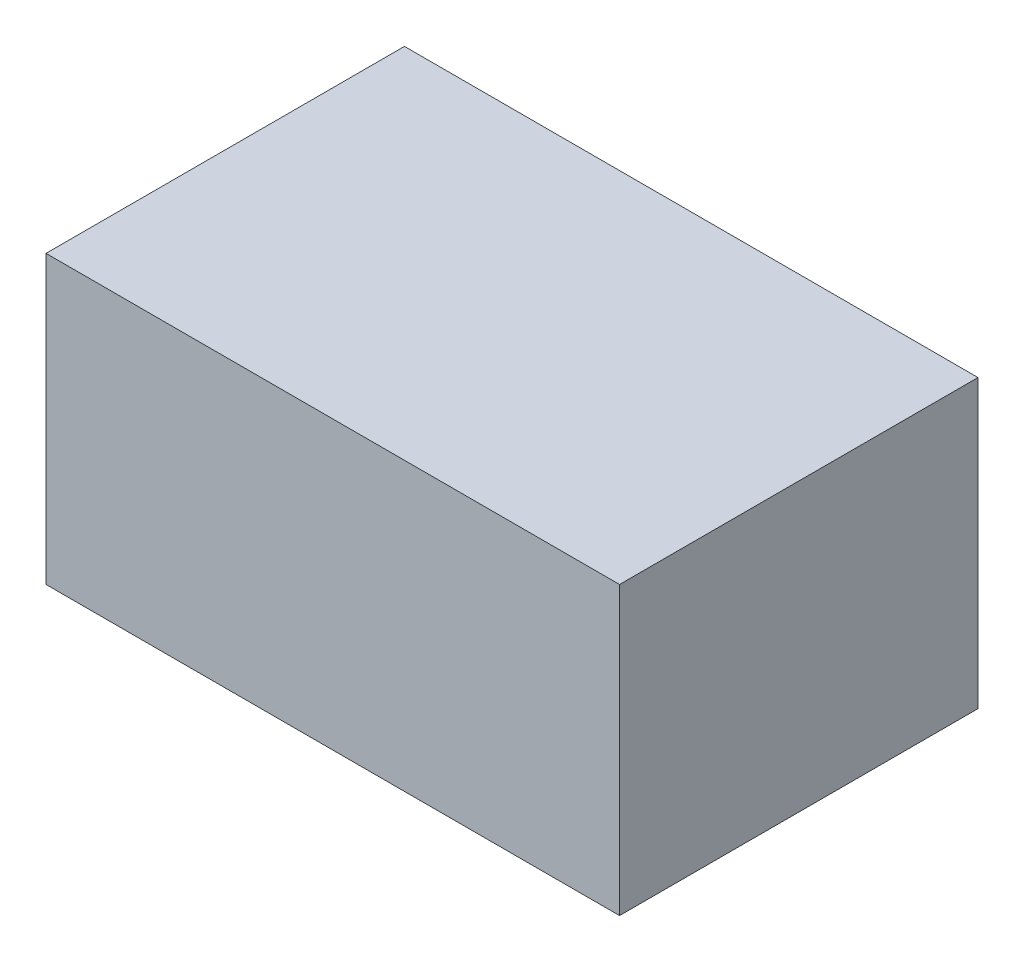
ISO-10303-21;
HEADER;
FILE_DESCRIPTION(('STEP AP214'),'2;1');
FILE_NAME('part.step','',(''),(''),'','','');
FILE_SCHEMA(('AUTOMOTIVE_DESIGN { 1 0 10303 214 1 1 1 1 }'));
ENDSEC;
DATA;
#1=APPLICATION_CONTEXT('core data for automotive mechanical design processes');
#2=APPLICATION_PROTOCOL_DEFINITION('international standard','automotive_design',2000,#1);
#3=PRODUCT_CONTEXT('',#1,'mechanical');
#4=PRODUCT('Part','Part','',(#3));
#5=PRODUCT_RELATED_PRODUCT_CATEGORY('part','',(#4));
#6=PRODUCT_DEFINITION_FORMATION('','',#4);
#7=PRODUCT_DEFINITION_CONTEXT('part definition',#1,'design');
#8=PRODUCT_DEFINITION('design','',#6,#7);
#9=PRODUCT_DEFINITION_SHAPE('','',#8);
#10=(LENGTH_UNIT() NAMED_UNIT(*) SI_UNIT(.MILLI.,.METRE.));
#11=(NAMED_UNIT(*) PLANE_ANGLE_UNIT() SI_UNIT($,.RADIAN.));
#12=(NAMED_UNIT(*) SI_UNIT($,.STERADIAN.) SOLID_ANGLE_UNIT());
#13=UNCERTAINTY_MEASURE_WITH_UNIT(LENGTH_MEASURE(1.E-05),#10,'distance_accuracy_value','');
#14=(GEOMETRIC_REPRESENTATION_CONTEXT(3) GLOBAL_UNCERTAINTY_ASSIGNED_CONTEXT((#13)) GLOBAL_UNIT_ASSIGNED_CONTEXT((#10,
#11,#12)) REPRESENTATION_CONTEXT('',''));
#15=CARTESIAN_POINT('',(0.,0.,0.));
#16=DIRECTION('',(0.,0.,1.));
#17=DIRECTION('',(1.,0.,0.));
#18=AXIS2_PLACEMENT_3D('',#15,#16,#17);
#19=CARTESIAN_POINT('',(-40.,40.,-25.));
#20=DIRECTION('',(1.,0.,0.));
#21=DIRECTION('',(0.,0.,-1.));
#22=AXIS2_PLACEMENT_3D('',#19,#20,#21);
#23=PLANE('',#22);
#24=DIRECTION('',(0.,0.,1.));
#25=VECTOR('',#24,1.);
#26=CARTESIAN_POINT('',(-40.,0.,-25.));
#27=LINE('',#26,#25);
#28=CARTESIAN_POINT('',(-40.,0.,-25.));
#29=VERTEX_POINT('',#28);
#30=CARTESIAN_POINT('',(-40.,0.,25.));
#31=VERTEX_POINT('',#30);
#32=EDGE_CURVE('E122',#29,#31,#27,.T.);
#33=ORIENTED_EDGE('',*,*,#32,.T.);
#34=DIRECTION('',(0.,-1.,0.));
#35=VECTOR('',#34,1.);
#36=CARTESIAN_POINT('',(-40.,40.,25.));
#37=LINE('',#36,#35);
#38=CARTESIAN_POINT('',(-40.,40.,25.));
#39=VERTEX_POINT('',#38);
#40=EDGE_CURVE('E11',#39,#31,#37,.T.);
#41=ORIENTED_EDGE('',*,*,#40,.F.);
#42=DIRECTION('',(0.,0.,1.));
#43=VECTOR('',#42,1.);
#44=CARTESIAN_POINT('',(-40.,40.,-25.));
#45=LINE('',#44,#43);
#46=CARTESIAN_POINT('',(-40.,40.,-25.));
#47=VERTEX_POINT('',#46);
#48=EDGE_CURVE('E117',#47,#39,#45,.T.);
#49=ORIENTED_EDGE('',*,*,#48,.F.);
#50=DIRECTION('',(0.,-1.,0.));
#51=VECTOR('',#50,1.);
#52=CARTESIAN_POINT('',(-40.,40.,-25.));
#53=LINE('',#52,#51);
#54=EDGE_CURVE('E112',#47,#29,#53,.T.);
#55=ORIENTED_EDGE('',*,*,#54,.T.);
#56=EDGE_LOOP('',(#33,#41,#49,#55));
#57=FACE_BOUND('',#56,.T.);
#58=ADVANCED_FACE('F35',(#57),#23,.F.);
#59=CARTESIAN_POINT('',(40.,40.,25.));
#60=DIRECTION('',(0.,0.,-1.));
#61=DIRECTION('',(-1.,0.,0.));
#62=AXIS2_PLACEMENT_3D('',#59,#60,#61);
#63=PLANE('',#62);
#64=DIRECTION('',(1.,0.,0.));
#65=VECTOR('',#64,1.);
#66=CARTESIAN_POINT('',(40.,0.,25.));
#67=LINE('',#66,#65);
#68=CARTESIAN_POINT('',(40.,0.,25.));
#69=VERTEX_POINT('',#68);
#70=EDGE_CURVE('E127',#31,#69,#67,.T.);
#71=ORIENTED_EDGE('',*,*,#70,.T.);
#72=DIRECTION('',(0.,-1.,0.));
#73=VECTOR('',#72,1.);
#74=CARTESIAN_POINT('',(40.,40.,25.));
#75=LINE('',#74,#73);
#76=CARTESIAN_POINT('',(40.,40.,25.));
#77=VERTEX_POINT('',#76);
#78=EDGE_CURVE('E45',#77,#69,#75,.T.);
#79=ORIENTED_EDGE('',*,*,#78,.F.);
#80=DIRECTION('',(1.,0.,0.));
#81=VECTOR('',#80,1.);
#82=CARTESIAN_POINT('',(40.,40.,25.));
#83=LINE('',#82,#81);
#84=EDGE_CURVE('E163',#39,#77,#83,.T.);
#85=ORIENTED_EDGE('',*,*,#84,.F.);
#86=ORIENTED_EDGE('',*,*,#40,.T.);
#87=EDGE_LOOP('',(#71,#79,#85,#86));
#88=FACE_BOUND('',#87,.T.);
#89=ADVANCED_FACE('F170',(#88),#63,.F.);
#90=CARTESIAN_POINT('',(40.,40.,-25.));
#91=DIRECTION('',(-1.,0.,0.));
#92=DIRECTION('',(0.,0.,1.));
#93=AXIS2_PLACEMENT_3D('',#90,#91,#92);
#94=PLANE('',#93);
#95=DIRECTION('',(0.,0.,-1.));
#96=VECTOR('',#95,1.);
#97=CARTESIAN_POINT('',(40.,0.,-25.));
#98=LINE('',#97,#96);
#99=CARTESIAN_POINT('',(40.,0.,-25.));
#100=VERTEX_POINT('',#99);
#101=EDGE_CURVE('E102',#69,#100,#98,.T.);
#102=ORIENTED_EDGE('',*,*,#101,.T.);
#103=DIRECTION('',(0.,-1.,0.));
#104=VECTOR('',#103,1.);
#105=CARTESIAN_POINT('',(40.,40.,-25.));
#106=LINE('',#105,#104);
#107=CARTESIAN_POINT('',(40.,40.,-25.));
#108=VERTEX_POINT('',#107);
#109=EDGE_CURVE('E114',#108,#100,#106,.T.);
#110=ORIENTED_EDGE('',*,*,#109,.F.);
#111=DIRECTION('',(0.,0.,-1.));
#112=VECTOR('',#111,1.);
#113=CARTESIAN_POINT('',(40.,40.,-25.));
#114=LINE('',#113,#112);
#115=EDGE_CURVE('E164',#77,#108,#114,.T.);
#116=ORIENTED_EDGE('',*,*,#115,.F.);
#117=ORIENTED_EDGE('',*,*,#78,.T.);
#118=EDGE_LOOP('',(#102,#110,#116,#117));
#119=FACE_BOUND('',#118,.T.);
#120=ADVANCED_FACE('F171',(#119),#94,.F.);
#121=CARTESIAN_POINT('',(40.,40.,-25.));
#122=DIRECTION('',(0.,0.,1.));
#123=DIRECTION('',(1.,0.,0.));
#124=AXIS2_PLACEMENT_3D('',#121,#122,#123);
#125=PLANE('',#124);
#126=DIRECTION('',(-1.,0.,0.));
#127=VECTOR('',#126,1.);
#128=CARTESIAN_POINT('',(40.,0.,-25.));
#129=LINE('',#128,#127);
#130=EDGE_CURVE('E108',#100,#29,#129,.T.);
#131=ORIENTED_EDGE('',*,*,#130,.T.);
#132=ORIENTED_EDGE('',*,*,#54,.F.);
#133=DIRECTION('',(-1.,0.,0.));
#134=VECTOR('',#133,1.);
#135=CARTESIAN_POINT('',(40.,40.,-25.));
#136=LINE('',#135,#134);
#137=EDGE_CURVE('E124',#108,#47,#136,.T.);
#138=ORIENTED_EDGE('',*,*,#137,.F.);
#139=ORIENTED_EDGE('',*,*,#109,.T.);
#140=EDGE_LOOP('',(#131,#132,#138,#139));
#141=FACE_BOUND('',#140,.T.);
#142=ADVANCED_FACE('F110',(#141),#125,.F.);
#143=CARTESIAN_POINT('',(0.,40.,0.));
#144=DIRECTION('',(0.,-1.,0.));
#145=DIRECTION('',(0.,0.,-1.));
#146=AXIS2_PLACEMENT_3D('',#143,#144,#145);
#147=PLANE('',#146);
#148=ORIENTED_EDGE('',*,*,#48,.T.);
#149=ORIENTED_EDGE('',*,*,#84,.T.);
#150=ORIENTED_EDGE('',*,*,#115,.T.);
#151=ORIENTED_EDGE('',*,*,#137,.T.);
#152=EDGE_LOOP('',(#148,#149,#150,#151));
#153=FACE_BOUND('',#152,.T.);
#154=ADVANCED_FACE('F167',(#153),#147,.F.);
#155=CARTESIAN_POINT('',(0.,0.,0.));
#156=DIRECTION('',(0.,-1.,0.));
#157=DIRECTION('',(0.,0.,-1.));
#158=AXIS2_PLACEMENT_3D('',#155,#156,#157);
#159=PLANE('',#158);
#160=DIRECTION('',(-1.,0.,0.));
#161=VECTOR('',#160,1.);
#162=CARTESIAN_POINT('',(34.,0.,19.));
#163=LINE('',#162,#161);
#164=CARTESIAN_POINT('',(34.,0.,19.));
#165=VERTEX_POINT('',#164);
#166=CARTESIAN_POINT('',(-34.,0.,19.));
#167=VERTEX_POINT('',#166);
#168=EDGE_CURVE('E54',#165,#167,#163,.T.);
#169=ORIENTED_EDGE('',*,*,#168,.F.);
#170=DIRECTION('',(0.,0.,1.));
#171=VECTOR('',#170,1.);
#172=CARTESIAN_POINT('',(34.,0.,-19.));
#173=LINE('',#172,#171);
#174=CARTESIAN_POINT('',(34.,0.,-19.));
#175=VERTEX_POINT('',#174);
#176=EDGE_CURVE('E150',#175,#165,#173,.T.);
#177=ORIENTED_EDGE('',*,*,#176,.F.);
#178=DIRECTION('',(1.,0.,0.));
#179=VECTOR('',#178,1.);
#180=CARTESIAN_POINT('',(-34.,0.,-19.));
#181=LINE('',#180,#179);
#182=CARTESIAN_POINT('',(-34.,0.,-19.));
#183=VERTEX_POINT('',#182);
#184=EDGE_CURVE('E153',#183,#175,#181,.T.);
#185=ORIENTED_EDGE('',*,*,#184,.F.);
#186=DIRECTION('',(0.,0.,-1.));
#187=VECTOR('',#186,1.);
#188=CARTESIAN_POINT('',(-34.,0.,19.));
#189=LINE('',#188,#187);
#190=EDGE_CURVE('E158',#167,#183,#189,.T.);
#191=ORIENTED_EDGE('',*,*,#190,.F.);
#192=EDGE_LOOP('',(#169,#177,#185,#191));
#193=FACE_BOUND('',#192,.T.);
#194=ORIENTED_EDGE('',*,*,#32,.F.);
#195=ORIENTED_EDGE('',*,*,#130,.F.);
#196=ORIENTED_EDGE('',*,*,#101,.F.);
#197=ORIENTED_EDGE('',*,*,#70,.F.);
#198=EDGE_LOOP('',(#194,#195,#196,#197));
#199=FACE_BOUND('',#198,.T.);
#200=ADVANCED_FACE('F126',(#193,#199),#159,.T.);
#201=CARTESIAN_POINT('',(34.,0.,19.));
#202=DIRECTION('',(0.,-0.500000000000001,-0.866025403784438));
#203=DIRECTION('',(0.,0.866025403784438,-0.500000000000001));
#204=AXIS2_PLACEMENT_3D('',#201,#202,#203);
#205=PLANE('',#204);
#206=ORIENTED_EDGE('',*,*,#168,.T.);
#207=DIRECTION('',(-0.447213595499959,-0.774596669241482,0.447213595499959));
#208=VECTOR('',#207,1.);
#209=CARTESIAN_POINT('',(-20.3999999999999,23.5558909829367,5.39999999999996));
#210=LINE('',#209,#208);
#211=CARTESIAN_POINT('',(-30.5358983848622,6.,15.5358983848622));
#212=VERTEX_POINT('',#211);
#213=EDGE_CURVE('E72',#212,#167,#210,.T.);
#214=ORIENTED_EDGE('',*,*,#213,.F.);
#215=DIRECTION('',(1.,0.,0.));
#216=VECTOR('',#215,1.);
#217=CARTESIAN_POINT('',(0.,6.,15.5358983848622));
#218=LINE('',#217,#216);
#219=CARTESIAN_POINT('',(30.5358983848622,6.,15.5358983848622));
#220=VERTEX_POINT('',#219);
#221=EDGE_CURVE('E148',#220,#212,#218,.F.);
#222=ORIENTED_EDGE('',*,*,#221,.F.);
#223=DIRECTION('',(0.447213595499959,-0.774596669241482,0.447213595499959));
#224=VECTOR('',#223,1.);
#225=CARTESIAN_POINT('',(26.4,13.1635861375235,11.4));
#226=LINE('',#225,#224);
#227=EDGE_CURVE('E77',#220,#165,#226,.T.);
#228=ORIENTED_EDGE('',*,*,#227,.T.);
#229=EDGE_LOOP('',(#206,#214,#222,#228));
#230=FACE_BOUND('',#229,.T.);
#231=ADVANCED_FACE('F190',(#230),#205,.T.);
#232=CARTESIAN_POINT('',(34.,0.,-19.));
#233=DIRECTION('',(-0.866025403784438,-0.500000000000001,0.));
#234=DIRECTION('',(0.500000000000001,-0.866025403784438,0.));
#235=AXIS2_PLACEMENT_3D('',#232,#233,#234);
#236=PLANE('',#235);
#237=ORIENTED_EDGE('',*,*,#176,.T.);
#238=ORIENTED_EDGE('',*,*,#227,.F.);
#239=DIRECTION('',(0.,0.,-1.));
#240=VECTOR('',#239,1.);
#241=CARTESIAN_POINT('',(30.5358983848622,6.,0.));
#242=LINE('',#241,#240);
#243=CARTESIAN_POINT('',(30.5358983848622,6.,-15.5358983848622));
#244=VERTEX_POINT('',#243);
#245=EDGE_CURVE('E143',#244,#220,#242,.F.);
#246=ORIENTED_EDGE('',*,*,#245,.F.);
#247=DIRECTION('',(0.447213595499959,-0.774596669241482,-0.447213595499959));
#248=VECTOR('',#247,1.);
#249=CARTESIAN_POINT('',(20.3999999999999,23.5558909829367,-5.39999999999994));
#250=LINE('',#249,#248);
#251=EDGE_CURVE('E130',#244,#175,#250,.T.);
#252=ORIENTED_EDGE('',*,*,#251,.T.);
#253=EDGE_LOOP('',(#237,#238,#246,#252));
#254=FACE_BOUND('',#253,.T.);
#255=ADVANCED_FACE('F188',(#254),#236,.T.);
#256=CARTESIAN_POINT('',(-34.,0.,-19.));
#257=DIRECTION('',(0.,-0.500000000000001,0.866025403784438));
#258=DIRECTION('',(0.,-0.866025403784438,-0.500000000000001));
#259=AXIS2_PLACEMENT_3D('',#256,#257,#258);
#260=PLANE('',#259);
#261=ORIENTED_EDGE('',*,*,#184,.T.);
#262=ORIENTED_EDGE('',*,*,#251,.F.);
#263=DIRECTION('',(-1.,0.,0.));
#264=VECTOR('',#263,1.);
#265=CARTESIAN_POINT('',(0.,6.,-15.5358983848622));
#266=LINE('',#265,#264);
#267=CARTESIAN_POINT('',(-30.5358983848622,6.,-15.5358983848622));
#268=VERTEX_POINT('',#267);
#269=EDGE_CURVE('E144',#268,#244,#266,.F.);
#270=ORIENTED_EDGE('',*,*,#269,.F.);
#271=DIRECTION('',(-0.447213595499959,-0.774596669241482,-0.447213595499959));
#272=VECTOR('',#271,1.);
#273=CARTESIAN_POINT('',(-26.4,13.1635861375235,-11.4));
#274=LINE('',#273,#272);
#275=EDGE_CURVE('E139',#268,#183,#274,.T.);
#276=ORIENTED_EDGE('',*,*,#275,.T.);
#277=EDGE_LOOP('',(#261,#262,#270,#276));
#278=FACE_BOUND('',#277,.T.);
#279=ADVANCED_FACE('F185',(#278),#260,.T.);
#280=CARTESIAN_POINT('',(-34.,0.,19.));
#281=DIRECTION('',(0.866025403784438,-0.500000000000001,0.));
#282=DIRECTION('',(0.500000000000001,0.866025403784438,0.));
#283=AXIS2_PLACEMENT_3D('',#280,#281,#282);
#284=PLANE('',#283);
#285=ORIENTED_EDGE('',*,*,#190,.T.);
#286=ORIENTED_EDGE('',*,*,#275,.F.);
#287=DIRECTION('',(0.,0.,1.));
#288=VECTOR('',#287,1.);
#289=CARTESIAN_POINT('',(-30.5358983848622,6.,0.));
#290=LINE('',#289,#288);
#291=EDGE_CURVE('E39',#212,#268,#290,.F.);
#292=ORIENTED_EDGE('',*,*,#291,.F.);
#293=ORIENTED_EDGE('',*,*,#213,.T.);
#294=EDGE_LOOP('',(#285,#286,#292,#293));
#295=FACE_BOUND('',#294,.T.);
#296=ADVANCED_FACE('F37',(#295),#284,.T.);
#297=CARTESIAN_POINT('',(0.,6.,0.));
#298=DIRECTION('',(0.,-1.,0.));
#299=DIRECTION('',(0.,0.,-1.));
#300=AXIS2_PLACEMENT_3D('',#297,#298,#299);
#301=PLANE('',#300);
#302=ORIENTED_EDGE('',*,*,#221,.T.);
#303=ORIENTED_EDGE('',*,*,#291,.T.);
#304=ORIENTED_EDGE('',*,*,#269,.T.);
#305=ORIENTED_EDGE('',*,*,#245,.T.);
#306=EDGE_LOOP('',(#302,#303,#304,#305));
#307=FACE_BOUND('',#306,.T.);
#308=ADVANCED_FACE('F208',(#307),#301,.T.);
#309=CLOSED_SHELL('',(#58,#89,#120,#142,#154,#200,#231,#255,#279,#296,#308));
#310=MANIFOLD_SOLID_BREP('B2',#309);
#311=ADVANCED_BREP_SHAPE_REPRESENTATION('',(#18,#310),#14);
#312=SHAPE_DEFINITION_REPRESENTATION(#9,#311);
ENDSEC;
END-ISO-10303-21;
